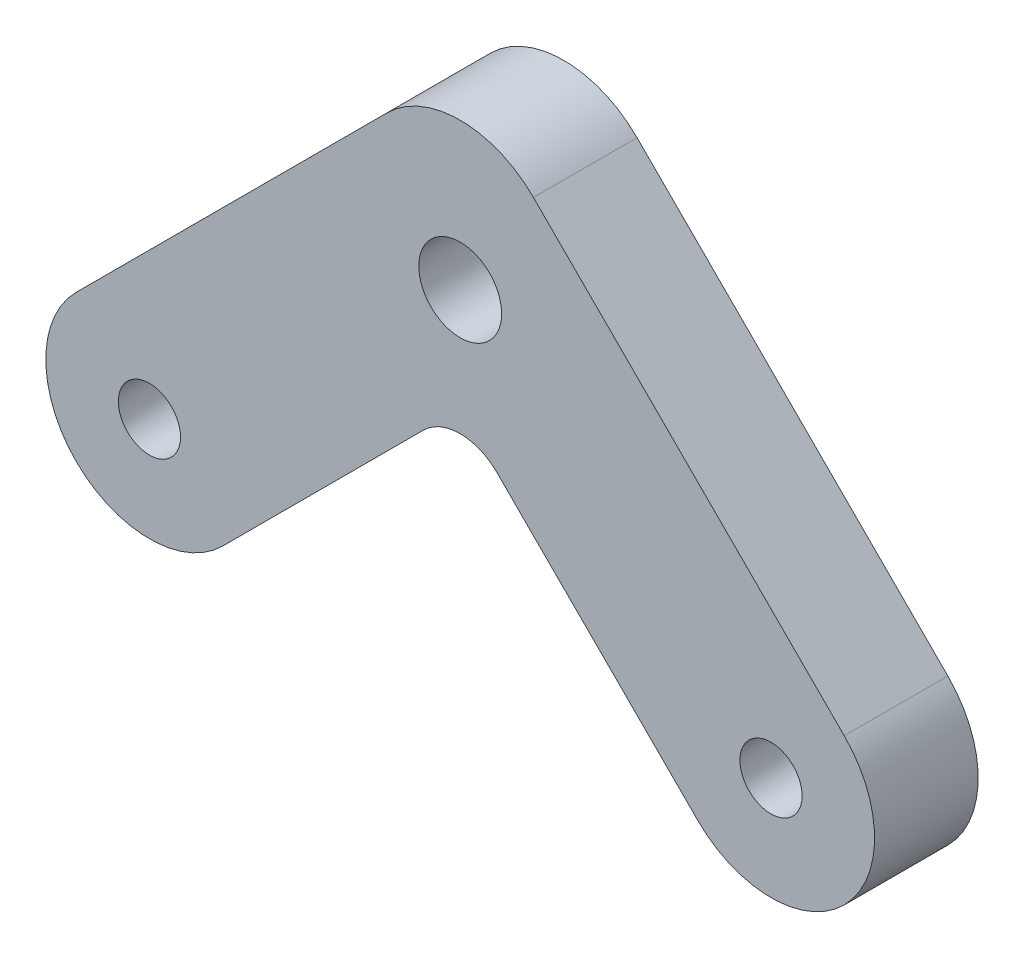
ISO-10303-21;
HEADER;
FILE_DESCRIPTION(('STEP AP214'),'2;1');
FILE_NAME('part.step','',(''),(''),'','','');
FILE_SCHEMA(('AUTOMOTIVE_DESIGN { 1 0 10303 214 1 1 1 1 }'));
ENDSEC;
DATA;
#1=APPLICATION_CONTEXT('core data for automotive mechanical design processes');
#2=APPLICATION_PROTOCOL_DEFINITION('international standard','automotive_design',2000,#1);
#3=PRODUCT_CONTEXT('',#1,'mechanical');
#4=PRODUCT('Part','Part','',(#3));
#5=PRODUCT_RELATED_PRODUCT_CATEGORY('part','',(#4));
#6=PRODUCT_DEFINITION_FORMATION('','',#4);
#7=PRODUCT_DEFINITION_CONTEXT('part definition',#1,'design');
#8=PRODUCT_DEFINITION('design','',#6,#7);
#9=PRODUCT_DEFINITION_SHAPE('','',#8);
#10=(LENGTH_UNIT() NAMED_UNIT(*) SI_UNIT(.MILLI.,.METRE.));
#11=(NAMED_UNIT(*) PLANE_ANGLE_UNIT() SI_UNIT($,.RADIAN.));
#12=(NAMED_UNIT(*) SI_UNIT($,.STERADIAN.) SOLID_ANGLE_UNIT());
#13=UNCERTAINTY_MEASURE_WITH_UNIT(LENGTH_MEASURE(1.E-05),#10,'distance_accuracy_value','');
#14=(GEOMETRIC_REPRESENTATION_CONTEXT(3) GLOBAL_UNCERTAINTY_ASSIGNED_CONTEXT((#13)) GLOBAL_UNIT_ASSIGNED_CONTEXT((#10,
#11,#12)) REPRESENTATION_CONTEXT('',''));
#15=CARTESIAN_POINT('',(0.,0.,0.));
#16=DIRECTION('',(0.,0.,1.));
#17=DIRECTION('',(1.,0.,0.));
#18=AXIS2_PLACEMENT_3D('',#15,#16,#17);
#19=CARTESIAN_POINT('',(0.,4.19370702443873,10.));
#20=DIRECTION('',(0.,0.,-1.));
#21=DIRECTION('',(-1.,0.,0.));
#22=AXIS2_PLACEMENT_3D('',#19,#20,#21);
#23=CYLINDRICAL_SURFACE('',#22,10.);
#24=CARTESIAN_POINT('',(0.,4.19370702443873,0.));
#25=DIRECTION('',(0.,0.,1.));
#26=DIRECTION('',(1.,0.,0.));
#27=AXIS2_PLACEMENT_3D('',#24,#25,#26);
#28=CIRCLE('',#27,10.);
#29=CARTESIAN_POINT('',(7.07106781186547,11.2647748363042,0.));
#30=VERTEX_POINT('',#29);
#31=CARTESIAN_POINT('',(-7.07106781186547,11.2647748363042,0.));
#32=VERTEX_POINT('',#31);
#33=EDGE_CURVE('E130',#30,#32,#28,.T.);
#34=ORIENTED_EDGE('',*,*,#33,.T.);
#35=DIRECTION('',(0.,0.,-1.));
#36=VECTOR('',#35,1.);
#37=CARTESIAN_POINT('',(-7.07106781186547,11.2647748363042,10.));
#38=LINE('',#37,#36);
#39=CARTESIAN_POINT('',(-7.07106781186547,11.2647748363042,10.));
#40=VERTEX_POINT('',#39);
#41=EDGE_CURVE('E110',#40,#32,#38,.T.);
#42=ORIENTED_EDGE('',*,*,#41,.F.);
#43=CARTESIAN_POINT('',(0.,4.19370702443873,10.));
#44=DIRECTION('',(0.,0.,1.));
#45=DIRECTION('',(1.,0.,0.));
#46=AXIS2_PLACEMENT_3D('',#43,#44,#45);
#47=CIRCLE('',#46,10.);
#48=CARTESIAN_POINT('',(7.07106781186547,11.2647748363042,10.));
#49=VERTEX_POINT('',#48);
#50=EDGE_CURVE('E118',#49,#40,#47,.T.);
#51=ORIENTED_EDGE('',*,*,#50,.F.);
#52=DIRECTION('',(0.,0.,-1.));
#53=VECTOR('',#52,1.);
#54=CARTESIAN_POINT('',(7.07106781186547,11.2647748363042,10.));
#55=LINE('',#54,#53);
#56=EDGE_CURVE('E146',#49,#30,#55,.T.);
#57=ORIENTED_EDGE('',*,*,#56,.T.);
#58=EDGE_LOOP('',(#34,#42,#51,#57));
#59=FACE_BOUND('',#58,.T.);
#60=ADVANCED_FACE('F43',(#59),#23,.T.);
#61=CARTESIAN_POINT('',(-7.07106781186547,11.2647748363042,10.));
#62=DIRECTION('',(0.707106781186548,-0.707106781186547,0.));
#63=DIRECTION('',(0.707106781186547,0.707106781186548,0.));
#64=AXIS2_PLACEMENT_3D('',#61,#62,#63);
#65=PLANE('',#64);
#66=DIRECTION('',(-0.707106781186547,-0.707106781186548,0.));
#67=VECTOR('',#66,1.);
#68=CARTESIAN_POINT('',(-7.07106781186547,11.2647748363042,0.));
#69=LINE('',#68,#67);
#70=CARTESIAN_POINT('',(-37.0710678118655,-18.7352251636958,0.));
#71=VERTEX_POINT('',#70);
#72=EDGE_CURVE('E160',#32,#71,#69,.T.);
#73=ORIENTED_EDGE('',*,*,#72,.T.);
#74=DIRECTION('',(0.,0.,-1.));
#75=VECTOR('',#74,1.);
#76=CARTESIAN_POINT('',(-37.0710678118655,-18.7352251636958,10.));
#77=LINE('',#76,#75);
#78=CARTESIAN_POINT('',(-37.0710678118655,-18.7352251636958,10.));
#79=VERTEX_POINT('',#78);
#80=EDGE_CURVE('E113',#79,#71,#77,.T.);
#81=ORIENTED_EDGE('',*,*,#80,.F.);
#82=DIRECTION('',(-0.707106781186547,-0.707106781186548,0.));
#83=VECTOR('',#82,1.);
#84=CARTESIAN_POINT('',(-7.07106781186547,11.2647748363042,10.));
#85=LINE('',#84,#83);
#86=EDGE_CURVE('E106',#40,#79,#85,.T.);
#87=ORIENTED_EDGE('',*,*,#86,.F.);
#88=ORIENTED_EDGE('',*,*,#41,.T.);
#89=EDGE_LOOP('',(#73,#81,#87,#88));
#90=FACE_BOUND('',#89,.T.);
#91=ADVANCED_FACE('F108',(#90),#65,.F.);
#92=CARTESIAN_POINT('',(-30.,-25.8062929755613,10.));
#93=DIRECTION('',(0.,0.,-1.));
#94=DIRECTION('',(-1.,0.,0.));
#95=AXIS2_PLACEMENT_3D('',#92,#93,#94);
#96=CYLINDRICAL_SURFACE('',#95,10.);
#97=CARTESIAN_POINT('',(-30.,-25.8062929755613,0.));
#98=DIRECTION('',(0.,0.,1.));
#99=DIRECTION('',(1.,0.,0.));
#100=AXIS2_PLACEMENT_3D('',#97,#98,#99);
#101=CIRCLE('',#100,10.);
#102=CARTESIAN_POINT('',(-22.9289321881345,-32.8773607874267,0.));
#103=VERTEX_POINT('',#102);
#104=EDGE_CURVE('E157',#71,#103,#101,.T.);
#105=ORIENTED_EDGE('',*,*,#104,.T.);
#106=DIRECTION('',(0.,0.,-1.));
#107=VECTOR('',#106,1.);
#108=CARTESIAN_POINT('',(-22.9289321881345,-32.8773607874267,10.));
#109=LINE('',#108,#107);
#110=CARTESIAN_POINT('',(-22.9289321881345,-32.8773607874267,10.));
#111=VERTEX_POINT('',#110);
#112=EDGE_CURVE('E135',#111,#103,#109,.T.);
#113=ORIENTED_EDGE('',*,*,#112,.F.);
#114=CARTESIAN_POINT('',(-30.,-25.8062929755613,10.));
#115=DIRECTION('',(0.,0.,1.));
#116=DIRECTION('',(1.,0.,0.));
#117=AXIS2_PLACEMENT_3D('',#114,#115,#116);
#118=CIRCLE('',#117,10.);
#119=EDGE_CURVE('E117',#79,#111,#118,.T.);
#120=ORIENTED_EDGE('',*,*,#119,.F.);
#121=ORIENTED_EDGE('',*,*,#80,.T.);
#122=EDGE_LOOP('',(#105,#113,#120,#121));
#123=FACE_BOUND('',#122,.T.);
#124=ADVANCED_FACE('F225',(#123),#96,.T.);
#125=CARTESIAN_POINT('',(0.,-9.94842859929222,10.));
#126=DIRECTION('',(0.707106781186548,-0.707106781186547,0.));
#127=DIRECTION('',(0.707106781186547,0.707106781186548,0.));
#128=AXIS2_PLACEMENT_3D('',#125,#126,#127);
#129=PLANE('',#128);
#130=DIRECTION('',(-0.707106781186547,-0.707106781186548,0.));
#131=VECTOR('',#130,1.);
#132=CARTESIAN_POINT('',(0.,-9.94842859929222,0.));
#133=LINE('',#132,#131);
#134=CARTESIAN_POINT('',(-3.53553390593274,-13.483962505225,0.));
#135=VERTEX_POINT('',#134);
#136=EDGE_CURVE('E155',#135,#103,#133,.T.);
#137=ORIENTED_EDGE('',*,*,#136,.F.);
#138=DIRECTION('',(0.,0.,-1.));
#139=VECTOR('',#138,1.);
#140=CARTESIAN_POINT('',(-3.53553390593274,-13.483962505225,10.));
#141=LINE('',#140,#139);
#142=CARTESIAN_POINT('',(-3.53553390593274,-13.483962505225,10.));
#143=VERTEX_POINT('',#142);
#144=EDGE_CURVE('E58',#135,#143,#141,.F.);
#145=ORIENTED_EDGE('',*,*,#144,.T.);
#146=DIRECTION('',(-0.707106781186547,-0.707106781186548,0.));
#147=VECTOR('',#146,1.);
#148=CARTESIAN_POINT('',(0.,-9.94842859929222,10.));
#149=LINE('',#148,#147);
#150=EDGE_CURVE('E170',#143,#111,#149,.T.);
#151=ORIENTED_EDGE('',*,*,#150,.T.);
#152=ORIENTED_EDGE('',*,*,#112,.T.);
#153=EDGE_LOOP('',(#137,#145,#151,#152));
#154=FACE_BOUND('',#153,.T.);
#155=ADVANCED_FACE('F230',(#154),#129,.T.);
#156=CARTESIAN_POINT('',(0.,-9.94842859929222,10.));
#157=DIRECTION('',(0.707106781186547,0.707106781186548,0.));
#158=DIRECTION('',(-0.707106781186548,0.707106781186547,0.));
#159=AXIS2_PLACEMENT_3D('',#156,#157,#158);
#160=PLANE('',#159);
#161=DIRECTION('',(0.707106781186548,-0.707106781186547,0.));
#162=VECTOR('',#161,1.);
#163=CARTESIAN_POINT('',(0.,-9.94842859929222,10.));
#164=LINE('',#163,#162);
#165=CARTESIAN_POINT('',(3.53553390593274,-13.483962505225,10.));
#166=VERTEX_POINT('',#165);
#167=CARTESIAN_POINT('',(22.9289321881345,-32.8773607874267,10.));
#168=VERTEX_POINT('',#167);
#169=EDGE_CURVE('E168',#166,#168,#164,.T.);
#170=ORIENTED_EDGE('',*,*,#169,.F.);
#171=DIRECTION('',(0.,0.,-1.));
#172=VECTOR('',#171,1.);
#173=CARTESIAN_POINT('',(3.53553390593274,-13.483962505225,10.));
#174=LINE('',#173,#172);
#175=CARTESIAN_POINT('',(3.53553390593274,-13.483962505225,0.));
#176=VERTEX_POINT('',#175);
#177=EDGE_CURVE('E131',#166,#176,#174,.T.);
#178=ORIENTED_EDGE('',*,*,#177,.T.);
#179=DIRECTION('',(0.707106781186548,-0.707106781186547,0.));
#180=VECTOR('',#179,1.);
#181=CARTESIAN_POINT('',(0.,-9.94842859929222,0.));
#182=LINE('',#181,#180);
#183=CARTESIAN_POINT('',(22.9289321881345,-32.8773607874267,0.));
#184=VERTEX_POINT('',#183);
#185=EDGE_CURVE('E153',#176,#184,#182,.T.);
#186=ORIENTED_EDGE('',*,*,#185,.T.);
#187=DIRECTION('',(0.,0.,-1.));
#188=VECTOR('',#187,1.);
#189=CARTESIAN_POINT('',(22.9289321881345,-32.8773607874267,10.));
#190=LINE('',#189,#188);
#191=EDGE_CURVE('E141',#168,#184,#190,.T.);
#192=ORIENTED_EDGE('',*,*,#191,.F.);
#193=EDGE_LOOP('',(#170,#178,#186,#192));
#194=FACE_BOUND('',#193,.T.);
#195=ADVANCED_FACE('F234',(#194),#160,.F.);
#196=CARTESIAN_POINT('',(30.,-25.8062929755613,10.));
#197=DIRECTION('',(0.,0.,-1.));
#198=DIRECTION('',(-1.,0.,0.));
#199=AXIS2_PLACEMENT_3D('',#196,#197,#198);
#200=CYLINDRICAL_SURFACE('',#199,10.);
#201=CARTESIAN_POINT('',(30.,-25.8062929755613,0.));
#202=DIRECTION('',(0.,0.,-1.));
#203=DIRECTION('',(-1.,0.,0.));
#204=AXIS2_PLACEMENT_3D('',#201,#202,#203);
#205=CIRCLE('',#204,10.);
#206=CARTESIAN_POINT('',(37.0710678118655,-18.7352251636958,0.));
#207=VERTEX_POINT('',#206);
#208=EDGE_CURVE('E150',#207,#184,#205,.T.);
#209=ORIENTED_EDGE('',*,*,#208,.F.);
#210=DIRECTION('',(0.,0.,-1.));
#211=VECTOR('',#210,1.);
#212=CARTESIAN_POINT('',(37.0710678118655,-18.7352251636958,10.));
#213=LINE('',#212,#211);
#214=CARTESIAN_POINT('',(37.0710678118655,-18.7352251636958,10.));
#215=VERTEX_POINT('',#214);
#216=EDGE_CURVE('E144',#215,#207,#213,.T.);
#217=ORIENTED_EDGE('',*,*,#216,.F.);
#218=CARTESIAN_POINT('',(30.,-25.8062929755613,10.));
#219=DIRECTION('',(0.,0.,-1.));
#220=DIRECTION('',(-1.,0.,0.));
#221=AXIS2_PLACEMENT_3D('',#218,#219,#220);
#222=CIRCLE('',#221,10.);
#223=EDGE_CURVE('E165',#215,#168,#222,.T.);
#224=ORIENTED_EDGE('',*,*,#223,.T.);
#225=ORIENTED_EDGE('',*,*,#191,.T.);
#226=EDGE_LOOP('',(#209,#217,#224,#225));
#227=FACE_BOUND('',#226,.T.);
#228=ADVANCED_FACE('F237',(#227),#200,.T.);
#229=CARTESIAN_POINT('',(7.07106781186547,11.2647748363042,10.));
#230=DIRECTION('',(0.707106781186547,0.707106781186548,0.));
#231=DIRECTION('',(-0.707106781186548,0.707106781186547,0.));
#232=AXIS2_PLACEMENT_3D('',#229,#230,#231);
#233=PLANE('',#232);
#234=DIRECTION('',(0.707106781186548,-0.707106781186547,0.));
#235=VECTOR('',#234,1.);
#236=CARTESIAN_POINT('',(7.07106781186547,11.2647748363042,0.));
#237=LINE('',#236,#235);
#238=EDGE_CURVE('E127',#30,#207,#237,.T.);
#239=ORIENTED_EDGE('',*,*,#238,.F.);
#240=ORIENTED_EDGE('',*,*,#56,.F.);
#241=DIRECTION('',(0.707106781186548,-0.707106781186547,0.));
#242=VECTOR('',#241,1.);
#243=CARTESIAN_POINT('',(7.07106781186547,11.2647748363042,10.));
#244=LINE('',#243,#242);
#245=EDGE_CURVE('E125',#49,#215,#244,.T.);
#246=ORIENTED_EDGE('',*,*,#245,.T.);
#247=ORIENTED_EDGE('',*,*,#216,.T.);
#248=EDGE_LOOP('',(#239,#240,#246,#247));
#249=FACE_BOUND('',#248,.T.);
#250=ADVANCED_FACE('F203',(#249),#233,.T.);
#251=CARTESIAN_POINT('',(0.,4.19370702443873,10.));
#252=DIRECTION('',(0.,0.,1.));
#253=DIRECTION('',(1.,0.,0.));
#254=AXIS2_PLACEMENT_3D('',#251,#252,#253);
#255=PLANE('',#254);
#256=CARTESIAN_POINT('',(0.,0.,10.));
#257=DIRECTION('',(0.,0.,1.));
#258=DIRECTION('',(1.,0.,0.));
#259=AXIS2_PLACEMENT_3D('',#256,#257,#258);
#260=CIRCLE('',#259,4.);
#261=CARTESIAN_POINT('',(4.,0.,10.));
#262=VERTEX_POINT('',#261);
#263=EDGE_CURVE('E185',#262,#262,#260,.T.);
#264=ORIENTED_EDGE('',*,*,#263,.F.);
#265=EDGE_LOOP('',(#264));
#266=FACE_BOUND('',#265,.T.);
#267=CARTESIAN_POINT('',(-30.,-25.8062929755613,10.));
#268=DIRECTION('',(0.,0.,1.));
#269=DIRECTION('',(1.,0.,0.));
#270=AXIS2_PLACEMENT_3D('',#267,#268,#269);
#271=CIRCLE('',#270,3.);
#272=CARTESIAN_POINT('',(-27.,-25.8062929755613,10.));
#273=VERTEX_POINT('',#272);
#274=EDGE_CURVE('E182',#273,#273,#271,.T.);
#275=ORIENTED_EDGE('',*,*,#274,.F.);
#276=EDGE_LOOP('',(#275));
#277=FACE_BOUND('',#276,.T.);
#278=CARTESIAN_POINT('',(30.,-25.8062929755613,10.));
#279=DIRECTION('',(0.,0.,1.));
#280=DIRECTION('',(1.,0.,0.));
#281=AXIS2_PLACEMENT_3D('',#278,#279,#280);
#282=CIRCLE('',#281,3.);
#283=CARTESIAN_POINT('',(33.,-25.8062929755613,10.));
#284=VERTEX_POINT('',#283);
#285=EDGE_CURVE('E176',#284,#284,#282,.T.);
#286=ORIENTED_EDGE('',*,*,#285,.F.);
#287=EDGE_LOOP('',(#286));
#288=FACE_BOUND('',#287,.T.);
#289=ORIENTED_EDGE('',*,*,#50,.T.);
#290=ORIENTED_EDGE('',*,*,#86,.T.);
#291=ORIENTED_EDGE('',*,*,#119,.T.);
#292=ORIENTED_EDGE('',*,*,#150,.F.);
#293=CARTESIAN_POINT('',(0.,-17.0194964111577,10.));
#294=DIRECTION('',(0.,0.,1.));
#295=DIRECTION('',(1.,0.,0.));
#296=AXIS2_PLACEMENT_3D('',#293,#294,#295);
#297=CIRCLE('',#296,5.);
#298=EDGE_CURVE('E12',#143,#166,#297,.F.);
#299=ORIENTED_EDGE('',*,*,#298,.T.);
#300=ORIENTED_EDGE('',*,*,#169,.T.);
#301=ORIENTED_EDGE('',*,*,#223,.F.);
#302=ORIENTED_EDGE('',*,*,#245,.F.);
#303=EDGE_LOOP('',(#289,#290,#291,#292,#299,#300,#301,#302));
#304=FACE_BOUND('',#303,.T.);
#305=ADVANCED_FACE('F122',(#266,#277,#288,#304),#255,.T.);
#306=CARTESIAN_POINT('',(0.,4.19370702443873,0.));
#307=DIRECTION('',(0.,0.,1.));
#308=DIRECTION('',(1.,0.,0.));
#309=AXIS2_PLACEMENT_3D('',#306,#307,#308);
#310=PLANE('',#309);
#311=CARTESIAN_POINT('',(0.,0.,0.));
#312=DIRECTION('',(0.,0.,1.));
#313=DIRECTION('',(1.,0.,0.));
#314=AXIS2_PLACEMENT_3D('',#311,#312,#313);
#315=CIRCLE('',#314,4.);
#316=CARTESIAN_POINT('',(4.,0.,0.));
#317=VERTEX_POINT('',#316);
#318=EDGE_CURVE('E163',#317,#317,#315,.T.);
#319=ORIENTED_EDGE('',*,*,#318,.T.);
#320=EDGE_LOOP('',(#319));
#321=FACE_BOUND('',#320,.T.);
#322=CARTESIAN_POINT('',(-30.,-25.8062929755613,0.));
#323=DIRECTION('',(0.,0.,1.));
#324=DIRECTION('',(1.,0.,0.));
#325=AXIS2_PLACEMENT_3D('',#322,#323,#324);
#326=CIRCLE('',#325,3.);
#327=CARTESIAN_POINT('',(-27.,-25.8062929755613,0.));
#328=VERTEX_POINT('',#327);
#329=EDGE_CURVE('E179',#328,#328,#326,.T.);
#330=ORIENTED_EDGE('',*,*,#329,.T.);
#331=EDGE_LOOP('',(#330));
#332=FACE_BOUND('',#331,.T.);
#333=CARTESIAN_POINT('',(30.,-25.8062929755613,0.));
#334=DIRECTION('',(0.,0.,1.));
#335=DIRECTION('',(1.,0.,0.));
#336=AXIS2_PLACEMENT_3D('',#333,#334,#335);
#337=CIRCLE('',#336,3.);
#338=CARTESIAN_POINT('',(33.,-25.8062929755613,0.));
#339=VERTEX_POINT('',#338);
#340=EDGE_CURVE('E173',#339,#339,#337,.T.);
#341=ORIENTED_EDGE('',*,*,#340,.T.);
#342=EDGE_LOOP('',(#341));
#343=FACE_BOUND('',#342,.T.);
#344=ORIENTED_EDGE('',*,*,#33,.F.);
#345=ORIENTED_EDGE('',*,*,#238,.T.);
#346=ORIENTED_EDGE('',*,*,#208,.T.);
#347=ORIENTED_EDGE('',*,*,#185,.F.);
#348=CARTESIAN_POINT('',(0.,-17.0194964111577,0.));
#349=DIRECTION('',(0.,0.,1.));
#350=DIRECTION('',(1.,0.,0.));
#351=AXIS2_PLACEMENT_3D('',#348,#349,#350);
#352=CIRCLE('',#351,5.);
#353=EDGE_CURVE('E51',#176,#135,#352,.T.);
#354=ORIENTED_EDGE('',*,*,#353,.T.);
#355=ORIENTED_EDGE('',*,*,#136,.T.);
#356=ORIENTED_EDGE('',*,*,#104,.F.);
#357=ORIENTED_EDGE('',*,*,#72,.F.);
#358=EDGE_LOOP('',(#344,#345,#346,#347,#354,#355,#356,#357));
#359=FACE_BOUND('',#358,.T.);
#360=ADVANCED_FACE('F191',(#321,#332,#343,#359),#310,.F.);
#361=CARTESIAN_POINT('',(30.,-25.8062929755613,0.));
#362=DIRECTION('',(0.,0.,1.));
#363=DIRECTION('',(1.,0.,0.));
#364=AXIS2_PLACEMENT_3D('',#361,#362,#363);
#365=CYLINDRICAL_SURFACE('',#364,3.);
#366=ORIENTED_EDGE('',*,*,#340,.F.);
#367=EDGE_LOOP('',(#366));
#368=FACE_BOUND('',#367,.T.);
#369=ORIENTED_EDGE('',*,*,#285,.T.);
#370=EDGE_LOOP('',(#369));
#371=FACE_BOUND('',#370,.T.);
#372=ADVANCED_FACE('F209',(#368,#371),#365,.F.);
#373=CARTESIAN_POINT('',(-30.,-25.8062929755613,0.));
#374=DIRECTION('',(0.,0.,1.));
#375=DIRECTION('',(1.,0.,0.));
#376=AXIS2_PLACEMENT_3D('',#373,#374,#375);
#377=CYLINDRICAL_SURFACE('',#376,3.);
#378=ORIENTED_EDGE('',*,*,#329,.F.);
#379=EDGE_LOOP('',(#378));
#380=FACE_BOUND('',#379,.T.);
#381=ORIENTED_EDGE('',*,*,#274,.T.);
#382=EDGE_LOOP('',(#381));
#383=FACE_BOUND('',#382,.T.);
#384=ADVANCED_FACE('F197',(#380,#383),#377,.F.);
#385=CARTESIAN_POINT('',(0.,0.,0.));
#386=DIRECTION('',(0.,0.,1.));
#387=DIRECTION('',(1.,0.,0.));
#388=AXIS2_PLACEMENT_3D('',#385,#386,#387);
#389=CYLINDRICAL_SURFACE('',#388,4.);
#390=ORIENTED_EDGE('',*,*,#318,.F.);
#391=EDGE_LOOP('',(#390));
#392=FACE_BOUND('',#391,.T.);
#393=ORIENTED_EDGE('',*,*,#263,.T.);
#394=EDGE_LOOP('',(#393));
#395=FACE_BOUND('',#394,.T.);
#396=ADVANCED_FACE('F194',(#392,#395),#389,.F.);
#397=CARTESIAN_POINT('',(0.,-17.0194964111577,10.));
#398=DIRECTION('',(0.,0.,-1.));
#399=DIRECTION('',(-1.,0.,0.));
#400=AXIS2_PLACEMENT_3D('',#397,#398,#399);
#401=CYLINDRICAL_SURFACE('',#400,5.);
#402=ORIENTED_EDGE('',*,*,#298,.F.);
#403=ORIENTED_EDGE('',*,*,#144,.F.);
#404=ORIENTED_EDGE('',*,*,#353,.F.);
#405=ORIENTED_EDGE('',*,*,#177,.F.);
#406=EDGE_LOOP('',(#402,#403,#404,#405));
#407=FACE_BOUND('',#406,.T.);
#408=ADVANCED_FACE('F45',(#407),#401,.F.);
#409=CLOSED_SHELL('',(#60,#91,#124,#155,#195,#228,#250,#305,#360,#372,#384,#396,#408));
#410=MANIFOLD_SOLID_BREP('B2',#409);
#411=ADVANCED_BREP_SHAPE_REPRESENTATION('',(#18,#410),#14);
#412=SHAPE_DEFINITION_REPRESENTATION(#9,#411);
ENDSEC;
END-ISO-10303-21;
